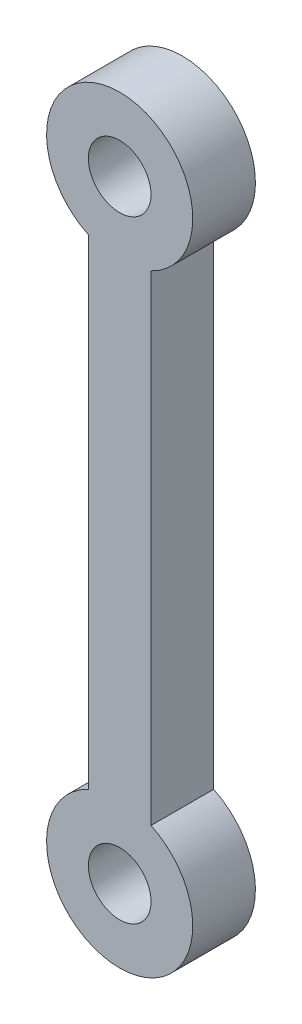
ISO-10303-21;
HEADER;
FILE_DESCRIPTION(('STEP AP214'),'2;1');
FILE_NAME('part.step','',(''),(''),'','','');
FILE_SCHEMA(('AUTOMOTIVE_DESIGN { 1 0 10303 214 1 1 1 1 }'));
ENDSEC;
DATA;
#1=APPLICATION_CONTEXT('core data for automotive mechanical design processes');
#2=APPLICATION_PROTOCOL_DEFINITION('international standard','automotive_design',2000,#1);
#3=PRODUCT_CONTEXT('',#1,'mechanical');
#4=PRODUCT('Part','Part','',(#3));
#5=PRODUCT_RELATED_PRODUCT_CATEGORY('part','',(#4));
#6=PRODUCT_DEFINITION_FORMATION('','',#4);
#7=PRODUCT_DEFINITION_CONTEXT('part definition',#1,'design');
#8=PRODUCT_DEFINITION('design','',#6,#7);
#9=PRODUCT_DEFINITION_SHAPE('','',#8);
#10=(LENGTH_UNIT() NAMED_UNIT(*) SI_UNIT(.MILLI.,.METRE.));
#11=(NAMED_UNIT(*) PLANE_ANGLE_UNIT() SI_UNIT($,.RADIAN.));
#12=(NAMED_UNIT(*) SI_UNIT($,.STERADIAN.) SOLID_ANGLE_UNIT());
#13=UNCERTAINTY_MEASURE_WITH_UNIT(LENGTH_MEASURE(1.E-05),#10,'distance_accuracy_value','');
#14=(GEOMETRIC_REPRESENTATION_CONTEXT(3) GLOBAL_UNCERTAINTY_ASSIGNED_CONTEXT((#13)) GLOBAL_UNIT_ASSIGNED_CONTEXT((#10,
#11,#12)) REPRESENTATION_CONTEXT('',''));
#15=CARTESIAN_POINT('',(0.,0.,0.));
#16=DIRECTION('',(0.,0.,1.));
#17=DIRECTION('',(1.,0.,0.));
#18=AXIS2_PLACEMENT_3D('',#15,#16,#17);
#19=CARTESIAN_POINT('',(-32.6110887746176,-24.4042334250125,3.));
#20=DIRECTION('',(0.,0.,-1.));
#21=DIRECTION('',(-1.,0.,0.));
#22=AXIS2_PLACEMENT_3D('',#19,#20,#21);
#23=CYLINDRICAL_SURFACE('',#22,3.5);
#24=CARTESIAN_POINT('',(-32.6110887746176,-24.4042334250125,0.));
#25=DIRECTION('',(0.,0.,1.));
#26=DIRECTION('',(1.,0.,0.));
#27=AXIS2_PLACEMENT_3D('',#24,#25,#26);
#28=CIRCLE('',#27,3.5);
#29=CARTESIAN_POINT('',(-31.1110887746176,-27.5665110851809,0.));
#30=VERTEX_POINT('',#29);
#31=CARTESIAN_POINT('',(-34.1110887746176,-27.5665110851809,0.));
#32=VERTEX_POINT('',#31);
#33=EDGE_CURVE('E113',#30,#32,#28,.T.);
#34=ORIENTED_EDGE('',*,*,#33,.T.);
#35=DIRECTION('',(0.,0.,-1.));
#36=VECTOR('',#35,1.);
#37=CARTESIAN_POINT('',(-34.1110887746176,-27.5665110851809,3.));
#38=LINE('',#37,#36);
#39=CARTESIAN_POINT('',(-34.1110887746176,-27.5665110851809,3.));
#40=VERTEX_POINT('',#39);
#41=EDGE_CURVE('E11',#40,#32,#38,.T.);
#42=ORIENTED_EDGE('',*,*,#41,.F.);
#43=CARTESIAN_POINT('',(-32.6110887746176,-24.4042334250125,3.));
#44=DIRECTION('',(0.,0.,1.));
#45=DIRECTION('',(1.,0.,0.));
#46=AXIS2_PLACEMENT_3D('',#43,#44,#45);
#47=CIRCLE('',#46,3.5);
#48=CARTESIAN_POINT('',(-31.1110887746176,-27.5665110851809,3.));
#49=VERTEX_POINT('',#48);
#50=EDGE_CURVE('E97',#49,#40,#47,.T.);
#51=ORIENTED_EDGE('',*,*,#50,.F.);
#52=DIRECTION('',(0.,0.,-1.));
#53=VECTOR('',#52,1.);
#54=CARTESIAN_POINT('',(-31.1110887746176,-27.5665110851809,3.));
#55=LINE('',#54,#53);
#56=EDGE_CURVE('E109',#49,#30,#55,.T.);
#57=ORIENTED_EDGE('',*,*,#56,.T.);
#58=EDGE_LOOP('',(#34,#42,#51,#57));
#59=FACE_BOUND('',#58,.T.);
#60=ADVANCED_FACE('F45',(#59),#23,.T.);
#61=CARTESIAN_POINT('',(-34.1110887746176,0.,3.));
#62=DIRECTION('',(1.,0.,0.));
#63=DIRECTION('',(0.,1.,0.));
#64=AXIS2_PLACEMENT_3D('',#61,#62,#63);
#65=PLANE('',#64);
#66=DIRECTION('',(0.,-1.,0.));
#67=VECTOR('',#66,1.);
#68=CARTESIAN_POINT('',(-34.1110887746176,0.,0.));
#69=LINE('',#68,#67);
#70=CARTESIAN_POINT('',(-34.1110887746176,-50.5665110851809,0.));
#71=VERTEX_POINT('',#70);
#72=EDGE_CURVE('E102',#32,#71,#69,.T.);
#73=ORIENTED_EDGE('',*,*,#72,.T.);
#74=DIRECTION('',(0.,0.,-1.));
#75=VECTOR('',#74,1.);
#76=CARTESIAN_POINT('',(-34.1110887746176,-50.5665110851809,3.));
#77=LINE('',#76,#75);
#78=CARTESIAN_POINT('',(-34.1110887746176,-50.5665110851809,3.));
#79=VERTEX_POINT('',#78);
#80=EDGE_CURVE('E54',#79,#71,#77,.T.);
#81=ORIENTED_EDGE('',*,*,#80,.F.);
#82=DIRECTION('',(0.,-1.,0.));
#83=VECTOR('',#82,1.);
#84=CARTESIAN_POINT('',(-34.1110887746176,0.,3.));
#85=LINE('',#84,#83);
#86=EDGE_CURVE('E92',#40,#79,#85,.T.);
#87=ORIENTED_EDGE('',*,*,#86,.F.);
#88=ORIENTED_EDGE('',*,*,#41,.T.);
#89=EDGE_LOOP('',(#73,#81,#87,#88));
#90=FACE_BOUND('',#89,.T.);
#91=ADVANCED_FACE('F101',(#90),#65,.F.);
#92=CARTESIAN_POINT('',(-32.6110887746176,-53.7287887453493,3.));
#93=DIRECTION('',(0.,0.,-1.));
#94=DIRECTION('',(-1.,0.,0.));
#95=AXIS2_PLACEMENT_3D('',#92,#93,#94);
#96=CYLINDRICAL_SURFACE('',#95,3.5);
#97=CARTESIAN_POINT('',(-32.6110887746176,-53.7287887453493,0.));
#98=DIRECTION('',(0.,0.,1.));
#99=DIRECTION('',(1.,0.,0.));
#100=AXIS2_PLACEMENT_3D('',#97,#98,#99);
#101=CIRCLE('',#100,3.5);
#102=CARTESIAN_POINT('',(-31.1110887746176,-50.5665110851809,0.));
#103=VERTEX_POINT('',#102);
#104=EDGE_CURVE('E79',#71,#103,#101,.T.);
#105=ORIENTED_EDGE('',*,*,#104,.T.);
#106=DIRECTION('',(0.,0.,-1.));
#107=VECTOR('',#106,1.);
#108=CARTESIAN_POINT('',(-31.1110887746176,-50.5665110851809,3.));
#109=LINE('',#108,#107);
#110=CARTESIAN_POINT('',(-31.1110887746176,-50.5665110851809,3.));
#111=VERTEX_POINT('',#110);
#112=EDGE_CURVE('E104',#111,#103,#109,.T.);
#113=ORIENTED_EDGE('',*,*,#112,.F.);
#114=CARTESIAN_POINT('',(-32.6110887746176,-53.7287887453493,3.));
#115=DIRECTION('',(0.,0.,1.));
#116=DIRECTION('',(1.,0.,0.));
#117=AXIS2_PLACEMENT_3D('',#114,#115,#116);
#118=CIRCLE('',#117,3.5);
#119=EDGE_CURVE('E95',#79,#111,#118,.T.);
#120=ORIENTED_EDGE('',*,*,#119,.F.);
#121=ORIENTED_EDGE('',*,*,#80,.T.);
#122=EDGE_LOOP('',(#105,#113,#120,#121));
#123=FACE_BOUND('',#122,.T.);
#124=ADVANCED_FACE('F105',(#123),#96,.T.);
#125=CARTESIAN_POINT('',(-31.1110887746176,0.,3.));
#126=DIRECTION('',(-1.,0.,0.));
#127=DIRECTION('',(0.,-1.,0.));
#128=AXIS2_PLACEMENT_3D('',#125,#126,#127);
#129=PLANE('',#128);
#130=DIRECTION('',(0.,1.,0.));
#131=VECTOR('',#130,1.);
#132=CARTESIAN_POINT('',(-31.1110887746176,0.,0.));
#133=LINE('',#132,#131);
#134=EDGE_CURVE('E85',#103,#30,#133,.T.);
#135=ORIENTED_EDGE('',*,*,#134,.T.);
#136=ORIENTED_EDGE('',*,*,#56,.F.);
#137=DIRECTION('',(0.,1.,0.));
#138=VECTOR('',#137,1.);
#139=CARTESIAN_POINT('',(-31.1110887746176,0.,3.));
#140=LINE('',#139,#138);
#141=EDGE_CURVE('E62',#111,#49,#140,.T.);
#142=ORIENTED_EDGE('',*,*,#141,.F.);
#143=ORIENTED_EDGE('',*,*,#112,.T.);
#144=EDGE_LOOP('',(#135,#136,#142,#143));
#145=FACE_BOUND('',#144,.T.);
#146=ADVANCED_FACE('F127',(#145),#129,.F.);
#147=CARTESIAN_POINT('',(0.,0.,3.));
#148=DIRECTION('',(0.,0.,1.));
#149=DIRECTION('',(1.,0.,0.));
#150=AXIS2_PLACEMENT_3D('',#147,#148,#149);
#151=PLANE('',#150);
#152=CARTESIAN_POINT('',(-32.6110887746176,-24.4042334250125,3.));
#153=DIRECTION('',(0.,0.,1.));
#154=DIRECTION('',(1.,0.,0.));
#155=AXIS2_PLACEMENT_3D('',#152,#153,#154);
#156=CIRCLE('',#155,1.5);
#157=CARTESIAN_POINT('',(-31.1110887746176,-24.4042334250125,3.));
#158=VERTEX_POINT('',#157);
#159=EDGE_CURVE('E142',#158,#158,#156,.T.);
#160=ORIENTED_EDGE('',*,*,#159,.F.);
#161=EDGE_LOOP('',(#160));
#162=FACE_BOUND('',#161,.T.);
#163=CARTESIAN_POINT('',(-32.6110887746176,-53.7287887453493,3.));
#164=DIRECTION('',(0.,0.,1.));
#165=DIRECTION('',(1.,0.,0.));
#166=AXIS2_PLACEMENT_3D('',#163,#164,#165);
#167=CIRCLE('',#166,1.5);
#168=CARTESIAN_POINT('',(-31.1110887746176,-53.7287887453493,3.));
#169=VERTEX_POINT('',#168);
#170=EDGE_CURVE('E138',#169,#169,#167,.T.);
#171=ORIENTED_EDGE('',*,*,#170,.F.);
#172=EDGE_LOOP('',(#171));
#173=FACE_BOUND('',#172,.T.);
#174=ORIENTED_EDGE('',*,*,#50,.T.);
#175=ORIENTED_EDGE('',*,*,#86,.T.);
#176=ORIENTED_EDGE('',*,*,#119,.T.);
#177=ORIENTED_EDGE('',*,*,#141,.T.);
#178=EDGE_LOOP('',(#174,#175,#176,#177));
#179=FACE_BOUND('',#178,.T.);
#180=ADVANCED_FACE('F93',(#162,#173,#179),#151,.T.);
#181=CARTESIAN_POINT('',(0.,0.,0.));
#182=DIRECTION('',(0.,0.,1.));
#183=DIRECTION('',(1.,0.,0.));
#184=AXIS2_PLACEMENT_3D('',#181,#182,#183);
#185=PLANE('',#184);
#186=CARTESIAN_POINT('',(-32.6110887746176,-24.4042334250125,0.));
#187=DIRECTION('',(0.,0.,1.));
#188=DIRECTION('',(1.,0.,0.));
#189=AXIS2_PLACEMENT_3D('',#186,#187,#188);
#190=CIRCLE('',#189,1.5);
#191=CARTESIAN_POINT('',(-31.1110887746176,-24.4042334250125,0.));
#192=VERTEX_POINT('',#191);
#193=EDGE_CURVE('E117',#192,#192,#190,.T.);
#194=ORIENTED_EDGE('',*,*,#193,.T.);
#195=EDGE_LOOP('',(#194));
#196=FACE_BOUND('',#195,.T.);
#197=CARTESIAN_POINT('',(-32.6110887746176,-53.7287887453493,0.));
#198=DIRECTION('',(0.,0.,1.));
#199=DIRECTION('',(1.,0.,0.));
#200=AXIS2_PLACEMENT_3D('',#197,#198,#199);
#201=CIRCLE('',#200,1.5);
#202=CARTESIAN_POINT('',(-31.1110887746176,-53.7287887453493,0.));
#203=VERTEX_POINT('',#202);
#204=EDGE_CURVE('E134',#203,#203,#201,.T.);
#205=ORIENTED_EDGE('',*,*,#204,.T.);
#206=EDGE_LOOP('',(#205));
#207=FACE_BOUND('',#206,.T.);
#208=ORIENTED_EDGE('',*,*,#33,.F.);
#209=ORIENTED_EDGE('',*,*,#134,.F.);
#210=ORIENTED_EDGE('',*,*,#104,.F.);
#211=ORIENTED_EDGE('',*,*,#72,.F.);
#212=EDGE_LOOP('',(#208,#209,#210,#211));
#213=FACE_BOUND('',#212,.T.);
#214=ADVANCED_FACE('F130',(#196,#207,#213),#185,.F.);
#215=CARTESIAN_POINT('',(-32.6110887746176,-53.7287887453493,0.));
#216=DIRECTION('',(0.,0.,1.));
#217=DIRECTION('',(1.,0.,0.));
#218=AXIS2_PLACEMENT_3D('',#215,#216,#217);
#219=CYLINDRICAL_SURFACE('',#218,1.5);
#220=ORIENTED_EDGE('',*,*,#204,.F.);
#221=EDGE_LOOP('',(#220));
#222=FACE_BOUND('',#221,.T.);
#223=ORIENTED_EDGE('',*,*,#170,.T.);
#224=EDGE_LOOP('',(#223));
#225=FACE_BOUND('',#224,.T.);
#226=ADVANCED_FACE('F155',(#222,#225),#219,.F.);
#227=CARTESIAN_POINT('',(-32.6110887746176,-24.4042334250125,0.));
#228=DIRECTION('',(0.,0.,1.));
#229=DIRECTION('',(1.,0.,0.));
#230=AXIS2_PLACEMENT_3D('',#227,#228,#229);
#231=CYLINDRICAL_SURFACE('',#230,1.5);
#232=ORIENTED_EDGE('',*,*,#193,.F.);
#233=EDGE_LOOP('',(#232));
#234=FACE_BOUND('',#233,.T.);
#235=ORIENTED_EDGE('',*,*,#159,.T.);
#236=EDGE_LOOP('',(#235));
#237=FACE_BOUND('',#236,.T.);
#238=ADVANCED_FACE('F152',(#234,#237),#231,.F.);
#239=CLOSED_SHELL('',(#60,#91,#124,#146,#180,#214,#226,#238));
#240=MANIFOLD_SOLID_BREP('B2',#239);
#241=ADVANCED_BREP_SHAPE_REPRESENTATION('',(#18,#240),#14);
#242=SHAPE_DEFINITION_REPRESENTATION(#9,#241);
ENDSEC;
END-ISO-10303-21;
